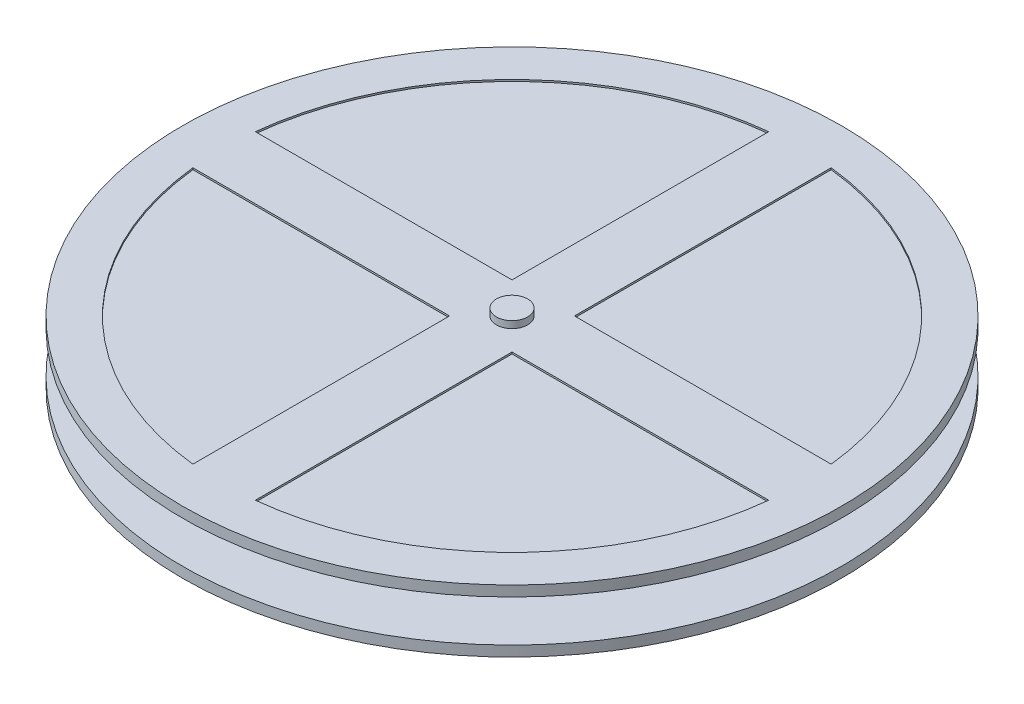
ISO-10303-21;
HEADER;
FILE_DESCRIPTION(('STEP AP214'),'2;1');
FILE_NAME('part.step','',(''),(''),'','','');
FILE_SCHEMA(('AUTOMOTIVE_DESIGN { 1 0 10303 214 1 1 1 1 }'));
ENDSEC;
DATA;
#1=APPLICATION_CONTEXT('core data for automotive mechanical design processes');
#2=APPLICATION_PROTOCOL_DEFINITION('international standard','automotive_design',2000,#1);
#3=PRODUCT_CONTEXT('',#1,'mechanical');
#4=PRODUCT('Part','Part','',(#3));
#5=PRODUCT_RELATED_PRODUCT_CATEGORY('part','',(#4));
#6=PRODUCT_DEFINITION_FORMATION('','',#4);
#7=PRODUCT_DEFINITION_CONTEXT('part definition',#1,'design');
#8=PRODUCT_DEFINITION('design','',#6,#7);
#9=PRODUCT_DEFINITION_SHAPE('','',#8);
#10=(LENGTH_UNIT() NAMED_UNIT(*) SI_UNIT(.MILLI.,.METRE.));
#11=(NAMED_UNIT(*) PLANE_ANGLE_UNIT() SI_UNIT($,.RADIAN.));
#12=(NAMED_UNIT(*) SI_UNIT($,.STERADIAN.) SOLID_ANGLE_UNIT());
#13=UNCERTAINTY_MEASURE_WITH_UNIT(LENGTH_MEASURE(1.E-05),#10,'distance_accuracy_value','');
#14=(GEOMETRIC_REPRESENTATION_CONTEXT(3) GLOBAL_UNCERTAINTY_ASSIGNED_CONTEXT((#13)) GLOBAL_UNIT_ASSIGNED_CONTEXT((#10,
#11,#12)) REPRESENTATION_CONTEXT('',''));
#15=CARTESIAN_POINT('',(0.,0.,0.));
#16=DIRECTION('',(0.,0.,1.));
#17=DIRECTION('',(1.,0.,0.));
#18=AXIS2_PLACEMENT_3D('',#15,#16,#17);
#19=CARTESIAN_POINT('',(0.,33.5,25.));
#20=DIRECTION('',(0.,-1.,0.));
#21=DIRECTION('',(0.,0.,-1.));
#22=AXIS2_PLACEMENT_3D('',#19,#20,#21);
#23=CYLINDRICAL_SURFACE('',#22,95.);
#24=CARTESIAN_POINT('',(0.,18.5,25.));
#25=DIRECTION('',(0.,-1.,0.));
#26=DIRECTION('',(0.,0.,-1.));
#27=AXIS2_PLACEMENT_3D('',#24,#25,#26);
#28=CIRCLE('',#27,95.);
#29=CARTESIAN_POINT('',(0.,18.5,-70.));
#30=VERTEX_POINT('',#29);
#31=EDGE_CURVE('E331',#30,#30,#28,.T.);
#32=ORIENTED_EDGE('',*,*,#31,.T.);
#33=EDGE_LOOP('',(#32));
#34=FACE_BOUND('',#33,.T.);
#35=CARTESIAN_POINT('',(0.,15.5,25.));
#36=DIRECTION('',(0.,1.,0.));
#37=DIRECTION('',(0.,0.,1.));
#38=AXIS2_PLACEMENT_3D('',#35,#36,#37);
#39=CIRCLE('',#38,95.);
#40=CARTESIAN_POINT('',(0.,15.5,120.));
#41=VERTEX_POINT('',#40);
#42=EDGE_CURVE('E337',#41,#41,#39,.T.);
#43=ORIENTED_EDGE('',*,*,#42,.T.);
#44=EDGE_LOOP('',(#43));
#45=FACE_BOUND('',#44,.T.);
#46=ADVANCED_FACE('F37',(#34,#45),#23,.T.);
#47=CARTESIAN_POINT('',(0.,35.5,25.));
#48=DIRECTION('',(0.,-1.,0.));
#49=DIRECTION('',(0.,0.,-1.));
#50=AXIS2_PLACEMENT_3D('',#47,#48,#49);
#51=CYLINDRICAL_SURFACE('',#50,4.5);
#52=CARTESIAN_POINT('',(0.,10.5,25.));
#53=DIRECTION('',(0.,-1.,0.));
#54=DIRECTION('',(0.,0.,-1.));
#55=AXIS2_PLACEMENT_3D('',#52,#53,#54);
#56=CIRCLE('',#55,4.5);
#57=CARTESIAN_POINT('',(0.,10.5,20.5));
#58=VERTEX_POINT('',#57);
#59=EDGE_CURVE('E46',#58,#58,#56,.F.);
#60=ORIENTED_EDGE('',*,*,#59,.T.);
#61=EDGE_LOOP('',(#60));
#62=FACE_BOUND('',#61,.T.);
#63=CARTESIAN_POINT('',(0.,15.5,25.));
#64=DIRECTION('',(0.,1.,0.));
#65=DIRECTION('',(0.,0.,1.));
#66=AXIS2_PLACEMENT_3D('',#63,#64,#65);
#67=CIRCLE('',#66,4.5);
#68=CARTESIAN_POINT('',(0.,15.5,29.5));
#69=VERTEX_POINT('',#68);
#70=EDGE_CURVE('E11',#69,#69,#67,.T.);
#71=ORIENTED_EDGE('',*,*,#70,.F.);
#72=EDGE_LOOP('',(#71));
#73=FACE_BOUND('',#72,.T.);
#74=ADVANCED_FACE('F470',(#62,#73),#51,.T.);
#75=CARTESIAN_POINT('',(0.,0.,50.));
#76=DIRECTION('',(0.,0.,-1.));
#77=DIRECTION('',(-1.,0.,0.));
#78=AXIS2_PLACEMENT_3D('',#75,#76,#77);
#79=PLANE('',#78);
#80=DIRECTION('',(0.,-1.,0.));
#81=VECTOR('',#80,1.);
#82=CARTESIAN_POINT('',(-36.,-0.999999999999999,50.));
#83=LINE('',#82,#81);
#84=CARTESIAN_POINT('',(-36.,9.,50.));
#85=VERTEX_POINT('',#84);
#86=CARTESIAN_POINT('',(-36.,-0.999999999999999,50.));
#87=VERTEX_POINT('',#86);
#88=EDGE_CURVE('E378',#85,#87,#83,.T.);
#89=ORIENTED_EDGE('',*,*,#88,.F.);
#90=DIRECTION('',(-1.,0.,0.));
#91=VECTOR('',#90,1.);
#92=CARTESIAN_POINT('',(-36.,9.,50.));
#93=LINE('',#92,#91);
#94=CARTESIAN_POINT('',(-26.,9.,50.));
#95=VERTEX_POINT('',#94);
#96=EDGE_CURVE('E386',#95,#85,#93,.T.);
#97=ORIENTED_EDGE('',*,*,#96,.F.);
#98=DIRECTION('',(0.,1.,0.));
#99=VECTOR('',#98,1.);
#100=CARTESIAN_POINT('',(-26.,-0.999999999999999,50.));
#101=LINE('',#100,#99);
#102=CARTESIAN_POINT('',(-26.,-0.999999999999999,50.));
#103=VERTEX_POINT('',#102);
#104=EDGE_CURVE('E383',#103,#95,#101,.T.);
#105=ORIENTED_EDGE('',*,*,#104,.F.);
#106=DIRECTION('',(1.,0.,0.));
#107=VECTOR('',#106,1.);
#108=CARTESIAN_POINT('',(-36.,-0.999999999999999,50.));
#109=LINE('',#108,#107);
#110=EDGE_CURVE('E380',#87,#103,#109,.T.);
#111=ORIENTED_EDGE('',*,*,#110,.F.);
#112=EDGE_LOOP('',(#89,#97,#105,#111));
#113=FACE_BOUND('',#112,.T.);
#114=DIRECTION('',(0.,1.,0.));
#115=VECTOR('',#114,1.);
#116=CARTESIAN_POINT('',(39.,-10.5,50.));
#117=LINE('',#116,#115);
#118=CARTESIAN_POINT('',(39.,-8.00000000000001,50.));
#119=VERTEX_POINT('',#118);
#120=CARTESIAN_POINT('',(39.,9.99999999999999,50.));
#121=VERTEX_POINT('',#120);
#122=EDGE_CURVE('E409',#119,#121,#117,.T.);
#123=ORIENTED_EDGE('',*,*,#122,.T.);
#124=DIRECTION('',(0.707106781186548,-0.707106781186548,0.));
#125=VECTOR('',#124,1.);
#126=CARTESIAN_POINT('',(38.5,10.5,50.));
#127=LINE('',#126,#125);
#128=CARTESIAN_POINT('',(38.5,10.5,50.));
#129=VERTEX_POINT('',#128);
#130=EDGE_CURVE('E463',#121,#129,#127,.F.);
#131=ORIENTED_EDGE('',*,*,#130,.T.);
#132=DIRECTION('',(-1.,0.,0.));
#133=VECTOR('',#132,1.);
#134=CARTESIAN_POINT('',(-39.,10.5,50.));
#135=LINE('',#134,#133);
#136=CARTESIAN_POINT('',(-38.5,10.5,50.));
#137=VERTEX_POINT('',#136);
#138=EDGE_CURVE('E412',#129,#137,#135,.T.);
#139=ORIENTED_EDGE('',*,*,#138,.T.);
#140=DIRECTION('',(0.707106781186548,0.707106781186548,0.));
#141=VECTOR('',#140,1.);
#142=CARTESIAN_POINT('',(-39.,10.,50.));
#143=LINE('',#142,#141);
#144=CARTESIAN_POINT('',(-39.,9.99999999999999,50.));
#145=VERTEX_POINT('',#144);
#146=EDGE_CURVE('E461',#137,#145,#143,.F.);
#147=ORIENTED_EDGE('',*,*,#146,.T.);
#148=DIRECTION('',(0.,-1.,0.));
#149=VECTOR('',#148,1.);
#150=CARTESIAN_POINT('',(-39.,-10.5,50.));
#151=LINE('',#150,#149);
#152=CARTESIAN_POINT('',(-39.,-8.,50.));
#153=VERTEX_POINT('',#152);
#154=EDGE_CURVE('E416',#145,#153,#151,.T.);
#155=ORIENTED_EDGE('',*,*,#154,.T.);
#156=DIRECTION('',(-0.707106781186548,0.707106781186548,0.));
#157=VECTOR('',#156,1.);
#158=CARTESIAN_POINT('',(-36.5,-10.5,50.));
#159=LINE('',#158,#157);
#160=CARTESIAN_POINT('',(-36.5,-10.5,50.));
#161=VERTEX_POINT('',#160);
#162=EDGE_CURVE('E443',#153,#161,#159,.F.);
#163=ORIENTED_EDGE('',*,*,#162,.T.);
#164=DIRECTION('',(1.,0.,0.));
#165=VECTOR('',#164,1.);
#166=CARTESIAN_POINT('',(-39.,-10.5,50.));
#167=LINE('',#166,#165);
#168=CARTESIAN_POINT('',(36.5,-10.5,50.));
#169=VERTEX_POINT('',#168);
#170=EDGE_CURVE('E418',#161,#169,#167,.T.);
#171=ORIENTED_EDGE('',*,*,#170,.T.);
#172=DIRECTION('',(-0.707106781186549,-0.707106781186546,0.));
#173=VECTOR('',#172,1.);
#174=CARTESIAN_POINT('',(39.,-8.00000000000001,50.));
#175=LINE('',#174,#173);
#176=EDGE_CURVE('E445',#169,#119,#175,.F.);
#177=ORIENTED_EDGE('',*,*,#176,.T.);
#178=EDGE_LOOP('',(#123,#131,#139,#147,#155,#163,#171,#177));
#179=FACE_BOUND('',#178,.T.);
#180=DIRECTION('',(-1.,0.,0.));
#181=VECTOR('',#180,1.);
#182=CARTESIAN_POINT('',(26.,9.,50.));
#183=LINE('',#182,#181);
#184=CARTESIAN_POINT('',(36.,9.,50.));
#185=VERTEX_POINT('',#184);
#186=CARTESIAN_POINT('',(26.,9.,50.));
#187=VERTEX_POINT('',#186);
#188=EDGE_CURVE('E347',#185,#187,#183,.T.);
#189=ORIENTED_EDGE('',*,*,#188,.F.);
#190=DIRECTION('',(0.,1.,0.));
#191=VECTOR('',#190,1.);
#192=CARTESIAN_POINT('',(36.,-0.999999999999999,50.));
#193=LINE('',#192,#191);
#194=CARTESIAN_POINT('',(36.,-0.999999999999999,50.));
#195=VERTEX_POINT('',#194);
#196=EDGE_CURVE('E355',#195,#185,#193,.T.);
#197=ORIENTED_EDGE('',*,*,#196,.F.);
#198=DIRECTION('',(1.,0.,0.));
#199=VECTOR('',#198,1.);
#200=CARTESIAN_POINT('',(26.,-0.999999999999999,50.));
#201=LINE('',#200,#199);
#202=CARTESIAN_POINT('',(26.,-0.999999999999999,50.));
#203=VERTEX_POINT('',#202);
#204=EDGE_CURVE('E352',#203,#195,#201,.T.);
#205=ORIENTED_EDGE('',*,*,#204,.F.);
#206=DIRECTION('',(0.,-1.,0.));
#207=VECTOR('',#206,1.);
#208=CARTESIAN_POINT('',(26.,-0.999999999999999,50.));
#209=LINE('',#208,#207);
#210=EDGE_CURVE('E349',#187,#203,#209,.T.);
#211=ORIENTED_EDGE('',*,*,#210,.F.);
#212=EDGE_LOOP('',(#189,#197,#205,#211));
#213=FACE_BOUND('',#212,.T.);
#214=ADVANCED_FACE('F514',(#113,#179,#213),#79,.F.);
#215=CARTESIAN_POINT('',(0.,0.,0.));
#216=DIRECTION('',(0.,0.,-1.));
#217=DIRECTION('',(-1.,0.,0.));
#218=AXIS2_PLACEMENT_3D('',#215,#216,#217);
#219=PLANE('',#218);
#220=DIRECTION('',(-1.,0.,0.));
#221=VECTOR('',#220,1.);
#222=CARTESIAN_POINT('',(-39.,10.5,0.));
#223=LINE('',#222,#221);
#224=CARTESIAN_POINT('',(38.5,10.5,0.));
#225=VERTEX_POINT('',#224);
#226=CARTESIAN_POINT('',(-38.5,10.5,0.));
#227=VERTEX_POINT('',#226);
#228=EDGE_CURVE('E424',#225,#227,#223,.T.);
#229=ORIENTED_EDGE('',*,*,#228,.F.);
#230=DIRECTION('',(-0.707106781186548,0.707106781186548,0.));
#231=VECTOR('',#230,1.);
#232=CARTESIAN_POINT('',(24.5,24.5,0.));
#233=LINE('',#232,#231);
#234=CARTESIAN_POINT('',(39.,9.99999999999999,0.));
#235=VERTEX_POINT('',#234);
#236=EDGE_CURVE('E457',#225,#235,#233,.F.);
#237=ORIENTED_EDGE('',*,*,#236,.T.);
#238=DIRECTION('',(0.,1.,0.));
#239=VECTOR('',#238,1.);
#240=CARTESIAN_POINT('',(39.,-10.5,0.));
#241=LINE('',#240,#239);
#242=CARTESIAN_POINT('',(39.,-8.00000000000001,0.));
#243=VERTEX_POINT('',#242);
#244=EDGE_CURVE('E408',#243,#235,#241,.T.);
#245=ORIENTED_EDGE('',*,*,#244,.F.);
#246=DIRECTION('',(0.707106781186549,0.707106781186546,0.));
#247=VECTOR('',#246,1.);
#248=CARTESIAN_POINT('',(23.4999999999999,-23.5,0.));
#249=LINE('',#248,#247);
#250=CARTESIAN_POINT('',(36.5,-10.5,0.));
#251=VERTEX_POINT('',#250);
#252=EDGE_CURVE('E436',#243,#251,#249,.F.);
#253=ORIENTED_EDGE('',*,*,#252,.T.);
#254=DIRECTION('',(1.,0.,0.));
#255=VECTOR('',#254,1.);
#256=CARTESIAN_POINT('',(-39.,-10.5,0.));
#257=LINE('',#256,#255);
#258=CARTESIAN_POINT('',(-36.5,-10.5,0.));
#259=VERTEX_POINT('',#258);
#260=EDGE_CURVE('E413',#259,#251,#257,.T.);
#261=ORIENTED_EDGE('',*,*,#260,.F.);
#262=DIRECTION('',(0.707106781186548,-0.707106781186548,0.));
#263=VECTOR('',#262,1.);
#264=CARTESIAN_POINT('',(-23.5,-23.5,0.));
#265=LINE('',#264,#263);
#266=CARTESIAN_POINT('',(-39.,-8.,0.));
#267=VERTEX_POINT('',#266);
#268=EDGE_CURVE('E433',#259,#267,#265,.F.);
#269=ORIENTED_EDGE('',*,*,#268,.T.);
#270=DIRECTION('',(0.,-1.,0.));
#271=VECTOR('',#270,1.);
#272=CARTESIAN_POINT('',(-39.,-10.5,0.));
#273=LINE('',#272,#271);
#274=CARTESIAN_POINT('',(-39.,9.99999999999999,0.));
#275=VERTEX_POINT('',#274);
#276=EDGE_CURVE('E427',#275,#267,#273,.T.);
#277=ORIENTED_EDGE('',*,*,#276,.F.);
#278=DIRECTION('',(-0.707106781186548,-0.707106781186548,0.));
#279=VECTOR('',#278,1.);
#280=CARTESIAN_POINT('',(-24.5,24.5,0.));
#281=LINE('',#280,#279);
#282=EDGE_CURVE('E455',#275,#227,#281,.F.);
#283=ORIENTED_EDGE('',*,*,#282,.T.);
#284=EDGE_LOOP('',(#229,#237,#245,#253,#261,#269,#277,#283));
#285=FACE_BOUND('',#284,.T.);
#286=DIRECTION('',(-1.,0.,0.));
#287=VECTOR('',#286,1.);
#288=CARTESIAN_POINT('',(-36.,9.,0.));
#289=LINE('',#288,#287);
#290=CARTESIAN_POINT('',(-26.,9.,0.));
#291=VERTEX_POINT('',#290);
#292=CARTESIAN_POINT('',(-36.,9.,0.));
#293=VERTEX_POINT('',#292);
#294=EDGE_CURVE('E381',#291,#293,#289,.T.);
#295=ORIENTED_EDGE('',*,*,#294,.T.);
#296=DIRECTION('',(0.,-1.,0.));
#297=VECTOR('',#296,1.);
#298=CARTESIAN_POINT('',(-36.,-0.999999999999999,0.));
#299=LINE('',#298,#297);
#300=CARTESIAN_POINT('',(-36.,-0.999999999999999,0.));
#301=VERTEX_POINT('',#300);
#302=EDGE_CURVE('E377',#293,#301,#299,.T.);
#303=ORIENTED_EDGE('',*,*,#302,.T.);
#304=DIRECTION('',(1.,0.,0.));
#305=VECTOR('',#304,1.);
#306=CARTESIAN_POINT('',(-36.,-0.999999999999999,0.));
#307=LINE('',#306,#305);
#308=CARTESIAN_POINT('',(-26.,-0.999999999999999,0.));
#309=VERTEX_POINT('',#308);
#310=EDGE_CURVE('E391',#301,#309,#307,.T.);
#311=ORIENTED_EDGE('',*,*,#310,.T.);
#312=DIRECTION('',(0.,1.,0.));
#313=VECTOR('',#312,1.);
#314=CARTESIAN_POINT('',(-26.,-0.999999999999999,0.));
#315=LINE('',#314,#313);
#316=EDGE_CURVE('E394',#309,#291,#315,.T.);
#317=ORIENTED_EDGE('',*,*,#316,.T.);
#318=EDGE_LOOP('',(#295,#303,#311,#317));
#319=FACE_BOUND('',#318,.T.);
#320=DIRECTION('',(0.,1.,0.));
#321=VECTOR('',#320,1.);
#322=CARTESIAN_POINT('',(36.,-0.999999999999999,0.));
#323=LINE('',#322,#321);
#324=CARTESIAN_POINT('',(36.,-0.999999999999999,0.));
#325=VERTEX_POINT('',#324);
#326=CARTESIAN_POINT('',(36.,9.,0.));
#327=VERTEX_POINT('',#326);
#328=EDGE_CURVE('E350',#325,#327,#323,.T.);
#329=ORIENTED_EDGE('',*,*,#328,.T.);
#330=DIRECTION('',(-1.,0.,0.));
#331=VECTOR('',#330,1.);
#332=CARTESIAN_POINT('',(26.,9.,0.));
#333=LINE('',#332,#331);
#334=CARTESIAN_POINT('',(26.,9.,0.));
#335=VERTEX_POINT('',#334);
#336=EDGE_CURVE('E346',#327,#335,#333,.T.);
#337=ORIENTED_EDGE('',*,*,#336,.T.);
#338=DIRECTION('',(0.,-1.,0.));
#339=VECTOR('',#338,1.);
#340=CARTESIAN_POINT('',(26.,-0.999999999999999,0.));
#341=LINE('',#340,#339);
#342=CARTESIAN_POINT('',(26.,-0.999999999999999,0.));
#343=VERTEX_POINT('',#342);
#344=EDGE_CURVE('E360',#335,#343,#341,.T.);
#345=ORIENTED_EDGE('',*,*,#344,.T.);
#346=DIRECTION('',(1.,0.,0.));
#347=VECTOR('',#346,1.);
#348=CARTESIAN_POINT('',(26.,-0.999999999999999,0.));
#349=LINE('',#348,#347);
#350=EDGE_CURVE('E363',#343,#325,#349,.T.);
#351=ORIENTED_EDGE('',*,*,#350,.T.);
#352=EDGE_LOOP('',(#329,#337,#345,#351));
#353=FACE_BOUND('',#352,.T.);
#354=ADVANCED_FACE('F491',(#285,#319,#353),#219,.T.);
#355=CARTESIAN_POINT('',(39.,-10.5,50.));
#356=DIRECTION('',(-1.,0.,0.));
#357=DIRECTION('',(0.,0.,1.));
#358=AXIS2_PLACEMENT_3D('',#355,#356,#357);
#359=PLANE('',#358);
#360=ORIENTED_EDGE('',*,*,#244,.T.);
#361=DIRECTION('',(0.,0.,1.));
#362=VECTOR('',#361,1.);
#363=CARTESIAN_POINT('',(39.,10.,50.));
#364=LINE('',#363,#362);
#365=EDGE_CURVE('E459',#235,#121,#364,.T.);
#366=ORIENTED_EDGE('',*,*,#365,.T.);
#367=ORIENTED_EDGE('',*,*,#122,.F.);
#368=DIRECTION('',(0.,0.,-1.));
#369=VECTOR('',#368,1.);
#370=CARTESIAN_POINT('',(39.,-8.00000000000001,50.));
#371=LINE('',#370,#369);
#372=EDGE_CURVE('E421',#119,#243,#371,.T.);
#373=ORIENTED_EDGE('',*,*,#372,.T.);
#374=EDGE_LOOP('',(#360,#366,#367,#373));
#375=FACE_BOUND('',#374,.T.);
#376=ADVANCED_FACE('F477',(#375),#359,.F.);
#377=CARTESIAN_POINT('',(-39.,10.5,50.));
#378=DIRECTION('',(0.,-1.,0.));
#379=DIRECTION('',(0.,0.,-1.));
#380=AXIS2_PLACEMENT_3D('',#377,#378,#379);
#381=PLANE('',#380);
#382=ORIENTED_EDGE('',*,*,#59,.F.);
#383=EDGE_LOOP('',(#382));
#384=FACE_BOUND('',#383,.T.);
#385=ORIENTED_EDGE('',*,*,#138,.F.);
#386=DIRECTION('',(0.,0.,-1.));
#387=VECTOR('',#386,1.);
#388=CARTESIAN_POINT('',(38.5,10.5,50.));
#389=LINE('',#388,#387);
#390=EDGE_CURVE('E452',#129,#225,#389,.T.);
#391=ORIENTED_EDGE('',*,*,#390,.T.);
#392=ORIENTED_EDGE('',*,*,#228,.T.);
#393=DIRECTION('',(0.,0.,1.));
#394=VECTOR('',#393,1.);
#395=CARTESIAN_POINT('',(-38.5,10.5,50.));
#396=LINE('',#395,#394);
#397=EDGE_CURVE('E450',#227,#137,#396,.T.);
#398=ORIENTED_EDGE('',*,*,#397,.T.);
#399=EDGE_LOOP('',(#385,#391,#392,#398));
#400=FACE_BOUND('',#399,.T.);
#401=ADVANCED_FACE('F473',(#384,#400),#381,.F.);
#402=CARTESIAN_POINT('',(-39.,-10.5,50.));
#403=DIRECTION('',(1.,0.,0.));
#404=DIRECTION('',(0.,0.,-1.));
#405=AXIS2_PLACEMENT_3D('',#402,#403,#404);
#406=PLANE('',#405);
#407=ORIENTED_EDGE('',*,*,#154,.F.);
#408=DIRECTION('',(0.,0.,-1.));
#409=VECTOR('',#408,1.);
#410=CARTESIAN_POINT('',(-39.,10.,50.));
#411=LINE('',#410,#409);
#412=EDGE_CURVE('E465',#145,#275,#411,.T.);
#413=ORIENTED_EDGE('',*,*,#412,.T.);
#414=ORIENTED_EDGE('',*,*,#276,.T.);
#415=DIRECTION('',(0.,0.,1.));
#416=VECTOR('',#415,1.);
#417=CARTESIAN_POINT('',(-39.,-8.,50.));
#418=LINE('',#417,#416);
#419=EDGE_CURVE('E447',#267,#153,#418,.T.);
#420=ORIENTED_EDGE('',*,*,#419,.T.);
#421=EDGE_LOOP('',(#407,#413,#414,#420));
#422=FACE_BOUND('',#421,.T.);
#423=ADVANCED_FACE('F476',(#422),#406,.F.);
#424=CARTESIAN_POINT('',(-39.,-10.5,50.));
#425=DIRECTION('',(0.,1.,0.));
#426=DIRECTION('',(0.,0.,1.));
#427=AXIS2_PLACEMENT_3D('',#424,#425,#426);
#428=PLANE('',#427);
#429=ORIENTED_EDGE('',*,*,#260,.T.);
#430=DIRECTION('',(0.,0.,1.));
#431=VECTOR('',#430,1.);
#432=CARTESIAN_POINT('',(36.5,-10.5,50.));
#433=LINE('',#432,#431);
#434=EDGE_CURVE('E441',#251,#169,#433,.T.);
#435=ORIENTED_EDGE('',*,*,#434,.T.);
#436=ORIENTED_EDGE('',*,*,#170,.F.);
#437=DIRECTION('',(0.,0.,-1.));
#438=VECTOR('',#437,1.);
#439=CARTESIAN_POINT('',(-36.5,-10.5,50.));
#440=LINE('',#439,#438);
#441=EDGE_CURVE('E438',#161,#259,#440,.T.);
#442=ORIENTED_EDGE('',*,*,#441,.T.);
#443=EDGE_LOOP('',(#429,#435,#436,#442));
#444=FACE_BOUND('',#443,.T.);
#445=ADVANCED_FACE('F502',(#444),#428,.F.);
#446=CARTESIAN_POINT('',(-36.,-0.999999999999999,50.));
#447=DIRECTION('',(1.,0.,0.));
#448=DIRECTION('',(0.,0.,-1.));
#449=AXIS2_PLACEMENT_3D('',#446,#447,#448);
#450=PLANE('',#449);
#451=ORIENTED_EDGE('',*,*,#302,.F.);
#452=DIRECTION('',(0.,0.,-1.));
#453=VECTOR('',#452,1.);
#454=CARTESIAN_POINT('',(-36.,9.,50.));
#455=LINE('',#454,#453);
#456=EDGE_CURVE('E388',#85,#293,#455,.T.);
#457=ORIENTED_EDGE('',*,*,#456,.F.);
#458=ORIENTED_EDGE('',*,*,#88,.T.);
#459=DIRECTION('',(0.,0.,-1.));
#460=VECTOR('',#459,1.);
#461=CARTESIAN_POINT('',(-36.,-0.999999999999999,50.));
#462=LINE('',#461,#460);
#463=EDGE_CURVE('E405',#87,#301,#462,.T.);
#464=ORIENTED_EDGE('',*,*,#463,.T.);
#465=EDGE_LOOP('',(#451,#457,#458,#464));
#466=FACE_BOUND('',#465,.T.);
#467=ADVANCED_FACE('F636',(#466),#450,.T.);
#468=CARTESIAN_POINT('',(-36.,-0.999999999999999,50.));
#469=DIRECTION('',(0.,1.,0.));
#470=DIRECTION('',(0.,0.,1.));
#471=AXIS2_PLACEMENT_3D('',#468,#469,#470);
#472=PLANE('',#471);
#473=ORIENTED_EDGE('',*,*,#310,.F.);
#474=ORIENTED_EDGE('',*,*,#463,.F.);
#475=ORIENTED_EDGE('',*,*,#110,.T.);
#476=DIRECTION('',(0.,0.,-1.));
#477=VECTOR('',#476,1.);
#478=CARTESIAN_POINT('',(-26.,-0.999999999999999,50.));
#479=LINE('',#478,#477);
#480=EDGE_CURVE('E403',#103,#309,#479,.T.);
#481=ORIENTED_EDGE('',*,*,#480,.T.);
#482=EDGE_LOOP('',(#473,#474,#475,#481));
#483=FACE_BOUND('',#482,.T.);
#484=ADVANCED_FACE('F641',(#483),#472,.T.);
#485=CARTESIAN_POINT('',(-26.,-0.999999999999999,50.));
#486=DIRECTION('',(-1.,0.,0.));
#487=DIRECTION('',(0.,0.,1.));
#488=AXIS2_PLACEMENT_3D('',#485,#486,#487);
#489=PLANE('',#488);
#490=ORIENTED_EDGE('',*,*,#316,.F.);
#491=ORIENTED_EDGE('',*,*,#480,.F.);
#492=ORIENTED_EDGE('',*,*,#104,.T.);
#493=DIRECTION('',(0.,0.,-1.));
#494=VECTOR('',#493,1.);
#495=CARTESIAN_POINT('',(-26.,9.,50.));
#496=LINE('',#495,#494);
#497=EDGE_CURVE('E401',#95,#291,#496,.T.);
#498=ORIENTED_EDGE('',*,*,#497,.T.);
#499=EDGE_LOOP('',(#490,#491,#492,#498));
#500=FACE_BOUND('',#499,.T.);
#501=ADVANCED_FACE('F645',(#500),#489,.T.);
#502=CARTESIAN_POINT('',(-36.,9.,50.));
#503=DIRECTION('',(0.,-1.,0.));
#504=DIRECTION('',(0.,0.,-1.));
#505=AXIS2_PLACEMENT_3D('',#502,#503,#504);
#506=PLANE('',#505);
#507=ORIENTED_EDGE('',*,*,#294,.F.);
#508=ORIENTED_EDGE('',*,*,#497,.F.);
#509=ORIENTED_EDGE('',*,*,#96,.T.);
#510=ORIENTED_EDGE('',*,*,#456,.T.);
#511=EDGE_LOOP('',(#507,#508,#509,#510));
#512=FACE_BOUND('',#511,.T.);
#513=ADVANCED_FACE('F649',(#512),#506,.T.);
#514=CARTESIAN_POINT('',(26.,9.,50.));
#515=DIRECTION('',(0.,-1.,0.));
#516=DIRECTION('',(0.,0.,-1.));
#517=AXIS2_PLACEMENT_3D('',#514,#515,#516);
#518=PLANE('',#517);
#519=ORIENTED_EDGE('',*,*,#336,.F.);
#520=DIRECTION('',(0.,0.,-1.));
#521=VECTOR('',#520,1.);
#522=CARTESIAN_POINT('',(36.,9.,50.));
#523=LINE('',#522,#521);
#524=EDGE_CURVE('E357',#185,#327,#523,.T.);
#525=ORIENTED_EDGE('',*,*,#524,.F.);
#526=ORIENTED_EDGE('',*,*,#188,.T.);
#527=DIRECTION('',(0.,0.,-1.));
#528=VECTOR('',#527,1.);
#529=CARTESIAN_POINT('',(26.,9.,50.));
#530=LINE('',#529,#528);
#531=EDGE_CURVE('E374',#187,#335,#530,.T.);
#532=ORIENTED_EDGE('',*,*,#531,.T.);
#533=EDGE_LOOP('',(#519,#525,#526,#532));
#534=FACE_BOUND('',#533,.T.);
#535=ADVANCED_FACE('F526',(#534),#518,.T.);
#536=CARTESIAN_POINT('',(26.,-0.999999999999999,50.));
#537=DIRECTION('',(1.,0.,0.));
#538=DIRECTION('',(0.,0.,-1.));
#539=AXIS2_PLACEMENT_3D('',#536,#537,#538);
#540=PLANE('',#539);
#541=ORIENTED_EDGE('',*,*,#344,.F.);
#542=ORIENTED_EDGE('',*,*,#531,.F.);
#543=ORIENTED_EDGE('',*,*,#210,.T.);
#544=DIRECTION('',(0.,0.,-1.));
#545=VECTOR('',#544,1.);
#546=CARTESIAN_POINT('',(26.,-0.999999999999999,50.));
#547=LINE('',#546,#545);
#548=EDGE_CURVE('E372',#203,#343,#547,.T.);
#549=ORIENTED_EDGE('',*,*,#548,.T.);
#550=EDGE_LOOP('',(#541,#542,#543,#549));
#551=FACE_BOUND('',#550,.T.);
#552=ADVANCED_FACE('F528',(#551),#540,.T.);
#553=CARTESIAN_POINT('',(26.,-0.999999999999999,50.));
#554=DIRECTION('',(0.,1.,0.));
#555=DIRECTION('',(0.,0.,1.));
#556=AXIS2_PLACEMENT_3D('',#553,#554,#555);
#557=PLANE('',#556);
#558=ORIENTED_EDGE('',*,*,#350,.F.);
#559=ORIENTED_EDGE('',*,*,#548,.F.);
#560=ORIENTED_EDGE('',*,*,#204,.T.);
#561=DIRECTION('',(0.,0.,-1.));
#562=VECTOR('',#561,1.);
#563=CARTESIAN_POINT('',(36.,-0.999999999999999,50.));
#564=LINE('',#563,#562);
#565=EDGE_CURVE('E370',#195,#325,#564,.T.);
#566=ORIENTED_EDGE('',*,*,#565,.T.);
#567=EDGE_LOOP('',(#558,#559,#560,#566));
#568=FACE_BOUND('',#567,.T.);
#569=ADVANCED_FACE('F536',(#568),#557,.T.);
#570=CARTESIAN_POINT('',(36.,-0.999999999999999,50.));
#571=DIRECTION('',(-1.,0.,0.));
#572=DIRECTION('',(0.,0.,1.));
#573=AXIS2_PLACEMENT_3D('',#570,#571,#572);
#574=PLANE('',#573);
#575=ORIENTED_EDGE('',*,*,#328,.F.);
#576=ORIENTED_EDGE('',*,*,#565,.F.);
#577=ORIENTED_EDGE('',*,*,#196,.T.);
#578=ORIENTED_EDGE('',*,*,#524,.T.);
#579=EDGE_LOOP('',(#575,#576,#577,#578));
#580=FACE_BOUND('',#579,.T.);
#581=ADVANCED_FACE('F534',(#580),#574,.T.);
#582=CARTESIAN_POINT('',(39.,-8.00000000000001,50.));
#583=DIRECTION('',(-0.707106781186546,0.707106781186549,0.));
#584=DIRECTION('',(0.,0.,-1.));
#585=AXIS2_PLACEMENT_3D('',#582,#583,#584);
#586=PLANE('',#585);
#587=ORIENTED_EDGE('',*,*,#176,.F.);
#588=ORIENTED_EDGE('',*,*,#434,.F.);
#589=ORIENTED_EDGE('',*,*,#252,.F.);
#590=ORIENTED_EDGE('',*,*,#372,.F.);
#591=EDGE_LOOP('',(#587,#588,#589,#590));
#592=FACE_BOUND('',#591,.T.);
#593=ADVANCED_FACE('F498',(#592),#586,.F.);
#594=CARTESIAN_POINT('',(-36.5,-10.5,50.));
#595=DIRECTION('',(0.707106781186547,0.707106781186547,0.));
#596=DIRECTION('',(0.,0.,-1.));
#597=AXIS2_PLACEMENT_3D('',#594,#595,#596);
#598=PLANE('',#597);
#599=ORIENTED_EDGE('',*,*,#162,.F.);
#600=ORIENTED_EDGE('',*,*,#419,.F.);
#601=ORIENTED_EDGE('',*,*,#268,.F.);
#602=ORIENTED_EDGE('',*,*,#441,.F.);
#603=EDGE_LOOP('',(#599,#600,#601,#602));
#604=FACE_BOUND('',#603,.T.);
#605=ADVANCED_FACE('F507',(#604),#598,.F.);
#606=CARTESIAN_POINT('',(38.5,10.5,50.));
#607=DIRECTION('',(-0.707106781186547,-0.707106781186547,0.));
#608=DIRECTION('',(0.,0.,-1.));
#609=AXIS2_PLACEMENT_3D('',#606,#607,#608);
#610=PLANE('',#609);
#611=ORIENTED_EDGE('',*,*,#130,.F.);
#612=ORIENTED_EDGE('',*,*,#365,.F.);
#613=ORIENTED_EDGE('',*,*,#236,.F.);
#614=ORIENTED_EDGE('',*,*,#390,.F.);
#615=EDGE_LOOP('',(#611,#612,#613,#614));
#616=FACE_BOUND('',#615,.T.);
#617=ADVANCED_FACE('F487',(#616),#610,.F.);
#618=CARTESIAN_POINT('',(-39.,10.,50.));
#619=DIRECTION('',(0.707106781186547,-0.707106781186547,0.));
#620=DIRECTION('',(0.,0.,-1.));
#621=AXIS2_PLACEMENT_3D('',#618,#619,#620);
#622=PLANE('',#621);
#623=ORIENTED_EDGE('',*,*,#146,.F.);
#624=ORIENTED_EDGE('',*,*,#397,.F.);
#625=ORIENTED_EDGE('',*,*,#282,.F.);
#626=ORIENTED_EDGE('',*,*,#412,.F.);
#627=EDGE_LOOP('',(#623,#624,#625,#626));
#628=FACE_BOUND('',#627,.T.);
#629=ADVANCED_FACE('F40',(#628),#622,.F.);
#630=CARTESIAN_POINT('',(0.,15.5,25.));
#631=DIRECTION('',(0.,1.,0.));
#632=DIRECTION('',(0.,0.,1.));
#633=AXIS2_PLACEMENT_3D('',#630,#631,#632);
#634=PLANE('',#633);
#635=ORIENTED_EDGE('',*,*,#42,.F.);
#636=EDGE_LOOP('',(#635));
#637=FACE_BOUND('',#636,.T.);
#638=ORIENTED_EDGE('',*,*,#70,.T.);
#639=EDGE_LOOP('',(#638));
#640=FACE_BOUND('',#639,.T.);
#641=ADVANCED_FACE('F601',(#637,#640),#634,.F.);
#642=CARTESIAN_POINT('',(0.,18.5,-70.));
#643=DIRECTION('',(0.,-1.,0.));
#644=DIRECTION('',(0.,0.,-1.));
#645=AXIS2_PLACEMENT_3D('',#642,#643,#644);
#646=PLANE('',#645);
#647=ORIENTED_EDGE('',*,*,#31,.F.);
#648=EDGE_LOOP('',(#647));
#649=FACE_BOUND('',#648,.T.);
#650=CARTESIAN_POINT('',(0.,18.5,25.));
#651=DIRECTION('',(0.,-1.,0.));
#652=DIRECTION('',(0.,0.,-1.));
#653=AXIS2_PLACEMENT_3D('',#650,#651,#652);
#654=CIRCLE('',#653,9.);
#655=CARTESIAN_POINT('',(0.,18.5,16.));
#656=VERTEX_POINT('',#655);
#657=EDGE_CURVE('E328',#656,#656,#654,.T.);
#658=ORIENTED_EDGE('',*,*,#657,.T.);
#659=EDGE_LOOP('',(#658));
#660=FACE_BOUND('',#659,.T.);
#661=ADVANCED_FACE('F593',(#649,#660),#646,.F.);
#662=CARTESIAN_POINT('',(0.,10.5,25.));
#663=DIRECTION('',(0.,-1.,0.));
#664=DIRECTION('',(0.,0.,-1.));
#665=AXIS2_PLACEMENT_3D('',#662,#663,#664);
#666=CYLINDRICAL_SURFACE('',#665,9.);
#667=ORIENTED_EDGE('',*,*,#657,.F.);
#668=EDGE_LOOP('',(#667));
#669=FACE_BOUND('',#668,.T.);
#670=CARTESIAN_POINT('',(0.,30.5,25.));
#671=DIRECTION('',(0.,-1.,0.));
#672=DIRECTION('',(0.,0.,-1.));
#673=AXIS2_PLACEMENT_3D('',#670,#671,#672);
#674=CIRCLE('',#673,9.);
#675=CARTESIAN_POINT('',(0.,30.5,16.));
#676=VERTEX_POINT('',#675);
#677=EDGE_CURVE('E325',#676,#676,#674,.T.);
#678=ORIENTED_EDGE('',*,*,#677,.T.);
#679=EDGE_LOOP('',(#678));
#680=FACE_BOUND('',#679,.T.);
#681=ADVANCED_FACE('F587',(#669,#680),#666,.T.);
#682=CARTESIAN_POINT('',(0.,30.5,-70.));
#683=DIRECTION('',(0.,1.,0.));
#684=DIRECTION('',(0.,0.,1.));
#685=AXIS2_PLACEMENT_3D('',#682,#683,#684);
#686=PLANE('',#685);
#687=ORIENTED_EDGE('',*,*,#677,.F.);
#688=EDGE_LOOP('',(#687));
#689=FACE_BOUND('',#688,.T.);
#690=CARTESIAN_POINT('',(0.,30.5,25.));
#691=DIRECTION('',(0.,-1.,0.));
#692=DIRECTION('',(0.,0.,-1.));
#693=AXIS2_PLACEMENT_3D('',#690,#691,#692);
#694=CIRCLE('',#693,95.);
#695=CARTESIAN_POINT('',(0.,30.5,-70.));
#696=VERTEX_POINT('',#695);
#697=EDGE_CURVE('E318',#696,#696,#694,.T.);
#698=ORIENTED_EDGE('',*,*,#697,.T.);
#699=EDGE_LOOP('',(#698));
#700=FACE_BOUND('',#699,.T.);
#701=ADVANCED_FACE('F583',(#689,#700),#686,.F.);
#702=CARTESIAN_POINT('',(0.,35.5,25.));
#703=DIRECTION('',(0.,1.,0.));
#704=DIRECTION('',(0.,0.,1.));
#705=AXIS2_PLACEMENT_3D('',#702,#703,#704);
#706=PLANE('',#705);
#707=CARTESIAN_POINT('',(0.,35.5,25.));
#708=DIRECTION('',(0.,1.,0.));
#709=DIRECTION('',(0.,0.,1.));
#710=AXIS2_PLACEMENT_3D('',#707,#708,#709);
#711=CIRCLE('',#710,4.5);
#712=CARTESIAN_POINT('',(0.,35.5,29.5));
#713=VERTEX_POINT('',#712);
#714=EDGE_CURVE('E341',#713,#713,#711,.T.);
#715=ORIENTED_EDGE('',*,*,#714,.T.);
#716=EDGE_LOOP('',(#715));
#717=FACE_BOUND('',#716,.T.);
#718=ADVANCED_FACE('F579',(#717),#706,.T.);
#719=CARTESIAN_POINT('',(0.,33.5,25.));
#720=DIRECTION('',(0.,1.,0.));
#721=DIRECTION('',(0.,0.,1.));
#722=AXIS2_PLACEMENT_3D('',#719,#720,#721);
#723=CIRCLE('',#722,4.5);
#724=CARTESIAN_POINT('',(0.,33.5,29.5));
#725=VERTEX_POINT('',#724);
#726=EDGE_CURVE('E334',#725,#725,#723,.T.);
#727=ORIENTED_EDGE('',*,*,#726,.T.);
#728=EDGE_LOOP('',(#727));
#729=FACE_BOUND('',#728,.T.);
#730=ORIENTED_EDGE('',*,*,#714,.F.);
#731=EDGE_LOOP('',(#730));
#732=FACE_BOUND('',#731,.T.);
#733=ADVANCED_FACE('F553',(#729,#732),#51,.T.);
#734=CARTESIAN_POINT('',(0.,33.5,25.));
#735=DIRECTION('',(0.,1.,0.));
#736=DIRECTION('',(0.,0.,1.));
#737=AXIS2_PLACEMENT_3D('',#734,#735,#736);
#738=PLANE('',#737);
#739=CARTESIAN_POINT('',(0.,33.5,25.));
#740=DIRECTION('',(0.,1.,0.));
#741=DIRECTION('',(1.,0.,0.));
#742=AXIS2_PLACEMENT_3D('',#739,#740,#741);
#743=CIRCLE('',#742,83.4930696189177);
#744=CARTESIAN_POINT('',(-9.00000000000029,33.5,-58.0065821148506));
#745=VERTEX_POINT('',#744);
#746=CARTESIAN_POINT('',(-83.0065821148507,33.5,16.0000000000003));
#747=VERTEX_POINT('',#746);
#748=EDGE_CURVE('E53',#745,#747,#743,.T.);
#749=ORIENTED_EDGE('',*,*,#748,.F.);
#750=DIRECTION('',(0.,0.,-1.));
#751=VECTOR('',#750,1.);
#752=CARTESIAN_POINT('',(-9.00000000000002,33.5,16.));
#753=LINE('',#752,#751);
#754=CARTESIAN_POINT('',(-9.00000000000002,33.5,16.));
#755=VERTEX_POINT('',#754);
#756=EDGE_CURVE('E240',#755,#745,#753,.T.);
#757=ORIENTED_EDGE('',*,*,#756,.F.);
#758=DIRECTION('',(1.,0.,0.));
#759=VECTOR('',#758,1.);
#760=CARTESIAN_POINT('',(-83.0065821148507,33.5,16.0000000000003));
#761=LINE('',#760,#759);
#762=EDGE_CURVE('E243',#747,#755,#761,.T.);
#763=ORIENTED_EDGE('',*,*,#762,.F.);
#764=EDGE_LOOP('',(#749,#757,#763));
#765=FACE_BOUND('',#764,.T.);
#766=CARTESIAN_POINT('',(0.,33.5,25.));
#767=DIRECTION('',(0.,1.,0.));
#768=DIRECTION('',(0.,0.,-1.));
#769=AXIS2_PLACEMENT_3D('',#766,#767,#768);
#770=CIRCLE('',#769,83.4930696189177);
#771=CARTESIAN_POINT('',(-83.0065821148506,33.5,34.));
#772=VERTEX_POINT('',#771);
#773=CARTESIAN_POINT('',(-8.99999999999999,33.5,108.006582114851));
#774=VERTEX_POINT('',#773);
#775=EDGE_CURVE('E61',#772,#774,#770,.T.);
#776=ORIENTED_EDGE('',*,*,#775,.F.);
#777=DIRECTION('',(-1.,0.,0.));
#778=VECTOR('',#777,1.);
#779=CARTESIAN_POINT('',(-9.,33.5,34.));
#780=LINE('',#779,#778);
#781=CARTESIAN_POINT('',(-9.,33.5,34.));
#782=VERTEX_POINT('',#781);
#783=EDGE_CURVE('E258',#782,#772,#780,.T.);
#784=ORIENTED_EDGE('',*,*,#783,.F.);
#785=DIRECTION('',(0.,0.,-1.));
#786=VECTOR('',#785,1.);
#787=CARTESIAN_POINT('',(-8.99999999999999,33.5,108.006582114851));
#788=LINE('',#787,#786);
#789=EDGE_CURVE('E266',#774,#782,#788,.T.);
#790=ORIENTED_EDGE('',*,*,#789,.F.);
#791=EDGE_LOOP('',(#776,#784,#790));
#792=FACE_BOUND('',#791,.T.);
#793=CARTESIAN_POINT('',(0.,33.5,25.));
#794=DIRECTION('',(0.,1.,0.));
#795=DIRECTION('',(-1.,0.,0.));
#796=AXIS2_PLACEMENT_3D('',#793,#794,#795);
#797=CIRCLE('',#796,83.4930696189177);
#798=CARTESIAN_POINT('',(9.00000000000088,33.5,108.006582114851));
#799=VERTEX_POINT('',#798);
#800=CARTESIAN_POINT('',(83.0065821148507,33.5,33.9999999999991));
#801=VERTEX_POINT('',#800);
#802=EDGE_CURVE('E287',#799,#801,#797,.T.);
#803=ORIENTED_EDGE('',*,*,#802,.F.);
#804=DIRECTION('',(0.,0.,1.));
#805=VECTOR('',#804,1.);
#806=CARTESIAN_POINT('',(9.0000000000001,33.5,33.9999999999999));
#807=LINE('',#806,#805);
#808=CARTESIAN_POINT('',(9.0000000000001,33.5,33.9999999999999));
#809=VERTEX_POINT('',#808);
#810=EDGE_CURVE('E280',#809,#799,#807,.T.);
#811=ORIENTED_EDGE('',*,*,#810,.F.);
#812=DIRECTION('',(-1.,0.,0.));
#813=VECTOR('',#812,1.);
#814=CARTESIAN_POINT('',(83.0065821148507,33.5,33.9999999999991));
#815=LINE('',#814,#813);
#816=EDGE_CURVE('E289',#801,#809,#815,.T.);
#817=ORIENTED_EDGE('',*,*,#816,.F.);
#818=EDGE_LOOP('',(#803,#811,#817));
#819=FACE_BOUND('',#818,.T.);
#820=CARTESIAN_POINT('',(0.,33.5,25.));
#821=DIRECTION('',(0.,1.,0.));
#822=DIRECTION('',(0.,0.,1.));
#823=AXIS2_PLACEMENT_3D('',#820,#821,#822);
#824=CIRCLE('',#823,83.4930696189177);
#825=CARTESIAN_POINT('',(83.0065821148507,33.5,16.));
#826=VERTEX_POINT('',#825);
#827=CARTESIAN_POINT('',(9.00000000000001,33.5,-58.0065821148507));
#828=VERTEX_POINT('',#827);
#829=EDGE_CURVE('E252',#826,#828,#824,.T.);
#830=ORIENTED_EDGE('',*,*,#829,.F.);
#831=DIRECTION('',(1.,0.,0.));
#832=VECTOR('',#831,1.);
#833=CARTESIAN_POINT('',(9.00000000000001,33.5,16.));
#834=LINE('',#833,#832);
#835=CARTESIAN_POINT('',(9.00000000000001,33.5,16.));
#836=VERTEX_POINT('',#835);
#837=EDGE_CURVE('E303',#836,#826,#834,.T.);
#838=ORIENTED_EDGE('',*,*,#837,.F.);
#839=DIRECTION('',(0.,0.,1.));
#840=VECTOR('',#839,1.);
#841=CARTESIAN_POINT('',(9.00000000000001,33.5,-58.0065821148506));
#842=LINE('',#841,#840);
#843=EDGE_CURVE('E311',#828,#836,#842,.T.);
#844=ORIENTED_EDGE('',*,*,#843,.F.);
#845=EDGE_LOOP('',(#830,#838,#844));
#846=FACE_BOUND('',#845,.T.);
#847=CARTESIAN_POINT('',(0.,33.5,25.));
#848=DIRECTION('',(0.,1.,0.));
#849=DIRECTION('',(0.,0.,1.));
#850=AXIS2_PLACEMENT_3D('',#847,#848,#849);
#851=CIRCLE('',#850,95.);
#852=CARTESIAN_POINT('',(0.,33.5,120.));
#853=VERTEX_POINT('',#852);
#854=EDGE_CURVE('E338',#853,#853,#851,.T.);
#855=ORIENTED_EDGE('',*,*,#854,.T.);
#856=EDGE_LOOP('',(#855));
#857=FACE_BOUND('',#856,.T.);
#858=ORIENTED_EDGE('',*,*,#726,.F.);
#859=EDGE_LOOP('',(#858));
#860=FACE_BOUND('',#859,.T.);
#861=ADVANCED_FACE('F559',(#765,#792,#819,#846,#857,#860),#738,.T.);
#862=ORIENTED_EDGE('',*,*,#697,.F.);
#863=EDGE_LOOP('',(#862));
#864=FACE_BOUND('',#863,.T.);
#865=ORIENTED_EDGE('',*,*,#854,.F.);
#866=EDGE_LOOP('',(#865));
#867=FACE_BOUND('',#866,.T.);
#868=ADVANCED_FACE('F548',(#864,#867),#23,.T.);
#869=CARTESIAN_POINT('',(0.,33.,25.));
#870=DIRECTION('',(0.,1.,0.));
#871=DIRECTION('',(0.,0.,1.));
#872=AXIS2_PLACEMENT_3D('',#869,#870,#871);
#873=CYLINDRICAL_SURFACE('',#872,83.4930696189177);
#874=ORIENTED_EDGE('',*,*,#829,.T.);
#875=DIRECTION('',(0.,1.,0.));
#876=VECTOR('',#875,1.);
#877=CARTESIAN_POINT('',(9.00000000000001,33.,-58.0065821148506));
#878=LINE('',#877,#876);
#879=CARTESIAN_POINT('',(9.00000000000001,33.,-58.0065821148506));
#880=VERTEX_POINT('',#879);
#881=EDGE_CURVE('E309',#880,#828,#878,.T.);
#882=ORIENTED_EDGE('',*,*,#881,.F.);
#883=CARTESIAN_POINT('',(0.,33.,25.));
#884=DIRECTION('',(0.,1.,0.));
#885=DIRECTION('',(0.,0.,1.));
#886=AXIS2_PLACEMENT_3D('',#883,#884,#885);
#887=CIRCLE('',#886,83.4930696189177);
#888=CARTESIAN_POINT('',(83.0065821148507,33.,16.));
#889=VERTEX_POINT('',#888);
#890=EDGE_CURVE('E299',#889,#880,#887,.T.);
#891=ORIENTED_EDGE('',*,*,#890,.F.);
#892=DIRECTION('',(0.,1.,0.));
#893=VECTOR('',#892,1.);
#894=CARTESIAN_POINT('',(83.0065821148507,33.,16.));
#895=LINE('',#894,#893);
#896=EDGE_CURVE('E316',#889,#826,#895,.T.);
#897=ORIENTED_EDGE('',*,*,#896,.T.);
#898=EDGE_LOOP('',(#874,#882,#891,#897));
#899=FACE_BOUND('',#898,.T.);
#900=ADVANCED_FACE('F558',(#899),#873,.F.);
#901=CARTESIAN_POINT('',(9.00000000000001,33.,16.));
#902=DIRECTION('',(0.,0.,1.));
#903=DIRECTION('',(1.,0.,0.));
#904=AXIS2_PLACEMENT_3D('',#901,#902,#903);
#905=PLANE('',#904);
#906=ORIENTED_EDGE('',*,*,#837,.T.);
#907=ORIENTED_EDGE('',*,*,#896,.F.);
#908=DIRECTION('',(1.,0.,0.));
#909=VECTOR('',#908,1.);
#910=CARTESIAN_POINT('',(9.00000000000001,33.,16.));
#911=LINE('',#910,#909);
#912=CARTESIAN_POINT('',(9.00000000000001,33.,16.));
#913=VERTEX_POINT('',#912);
#914=EDGE_CURVE('E306',#913,#889,#911,.T.);
#915=ORIENTED_EDGE('',*,*,#914,.F.);
#916=DIRECTION('',(0.,1.,0.));
#917=VECTOR('',#916,1.);
#918=CARTESIAN_POINT('',(9.00000000000001,33.,16.));
#919=LINE('',#918,#917);
#920=EDGE_CURVE('E319',#913,#836,#919,.T.);
#921=ORIENTED_EDGE('',*,*,#920,.T.);
#922=EDGE_LOOP('',(#906,#907,#915,#921));
#923=FACE_BOUND('',#922,.T.);
#924=ADVANCED_FACE('F565',(#923),#905,.F.);
#925=CARTESIAN_POINT('',(9.00000000000001,33.,-58.0065821148506));
#926=DIRECTION('',(-1.,0.,0.));
#927=DIRECTION('',(0.,0.,1.));
#928=AXIS2_PLACEMENT_3D('',#925,#926,#927);
#929=PLANE('',#928);
#930=ORIENTED_EDGE('',*,*,#843,.T.);
#931=ORIENTED_EDGE('',*,*,#920,.F.);
#932=DIRECTION('',(0.,0.,1.));
#933=VECTOR('',#932,1.);
#934=CARTESIAN_POINT('',(9.00000000000001,33.,-58.0065821148506));
#935=LINE('',#934,#933);
#936=EDGE_CURVE('E302',#880,#913,#935,.T.);
#937=ORIENTED_EDGE('',*,*,#936,.F.);
#938=ORIENTED_EDGE('',*,*,#881,.T.);
#939=EDGE_LOOP('',(#930,#931,#937,#938));
#940=FACE_BOUND('',#939,.T.);
#941=ADVANCED_FACE('F797',(#940),#929,.F.);
#942=CARTESIAN_POINT('',(0.,33.,25.));
#943=DIRECTION('',(0.,1.,0.));
#944=DIRECTION('',(0.,0.,1.));
#945=AXIS2_PLACEMENT_3D('',#942,#943,#944);
#946=PLANE('',#945);
#947=ORIENTED_EDGE('',*,*,#890,.T.);
#948=ORIENTED_EDGE('',*,*,#936,.T.);
#949=ORIENTED_EDGE('',*,*,#914,.T.);
#950=EDGE_LOOP('',(#947,#948,#949));
#951=FACE_BOUND('',#950,.T.);
#952=ADVANCED_FACE('F807',(#951),#946,.T.);
#953=CARTESIAN_POINT('',(0.,33.,25.));
#954=DIRECTION('',(0.,1.,0.));
#955=DIRECTION('',(0.,0.,1.));
#956=AXIS2_PLACEMENT_3D('',#953,#954,#955);
#957=CYLINDRICAL_SURFACE('',#956,83.4930696189177);
#958=ORIENTED_EDGE('',*,*,#802,.T.);
#959=DIRECTION('',(0.,1.,0.));
#960=VECTOR('',#959,1.);
#961=CARTESIAN_POINT('',(83.0065821148507,33.,33.9999999999991));
#962=LINE('',#961,#960);
#963=CARTESIAN_POINT('',(83.0065821148507,33.,33.9999999999991));
#964=VERTEX_POINT('',#963);
#965=EDGE_CURVE('E286',#964,#801,#962,.T.);
#966=ORIENTED_EDGE('',*,*,#965,.F.);
#967=CARTESIAN_POINT('',(0.,33.,25.));
#968=DIRECTION('',(0.,1.,0.));
#969=DIRECTION('',(-1.,0.,0.));
#970=AXIS2_PLACEMENT_3D('',#967,#968,#969);
#971=CIRCLE('',#970,83.4930696189177);
#972=CARTESIAN_POINT('',(9.00000000000088,33.,108.006582114851));
#973=VERTEX_POINT('',#972);
#974=EDGE_CURVE('E276',#973,#964,#971,.T.);
#975=ORIENTED_EDGE('',*,*,#974,.F.);
#976=DIRECTION('',(0.,1.,0.));
#977=VECTOR('',#976,1.);
#978=CARTESIAN_POINT('',(9.00000000000088,33.,108.006582114851));
#979=LINE('',#978,#977);
#980=EDGE_CURVE('E267',#973,#799,#979,.T.);
#981=ORIENTED_EDGE('',*,*,#980,.T.);
#982=EDGE_LOOP('',(#958,#966,#975,#981));
#983=FACE_BOUND('',#982,.T.);
#984=ADVANCED_FACE('F816',(#983),#957,.F.);
#985=CARTESIAN_POINT('',(9.0000000000001,33.,33.9999999999999));
#986=DIRECTION('',(-1.,0.,0.));
#987=DIRECTION('',(0.,0.,1.));
#988=AXIS2_PLACEMENT_3D('',#985,#986,#987);
#989=PLANE('',#988);
#990=ORIENTED_EDGE('',*,*,#810,.T.);
#991=ORIENTED_EDGE('',*,*,#980,.F.);
#992=DIRECTION('',(0.,0.,1.));
#993=VECTOR('',#992,1.);
#994=CARTESIAN_POINT('',(9.0000000000001,33.,33.9999999999999));
#995=LINE('',#994,#993);
#996=CARTESIAN_POINT('',(9.0000000000001,33.,33.9999999999999));
#997=VERTEX_POINT('',#996);
#998=EDGE_CURVE('E283',#997,#973,#995,.T.);
#999=ORIENTED_EDGE('',*,*,#998,.F.);
#1000=DIRECTION('',(0.,1.,0.));
#1001=VECTOR('',#1000,1.);
#1002=CARTESIAN_POINT('',(9.0000000000001,33.,33.9999999999999));
#1003=LINE('',#1002,#1001);
#1004=EDGE_CURVE('E295',#997,#809,#1003,.T.);
#1005=ORIENTED_EDGE('',*,*,#1004,.T.);
#1006=EDGE_LOOP('',(#990,#991,#999,#1005));
#1007=FACE_BOUND('',#1006,.T.);
#1008=ADVANCED_FACE('F834',(#1007),#989,.F.);
#1009=CARTESIAN_POINT('',(83.0065821148507,33.,33.9999999999991));
#1010=DIRECTION('',(0.,0.,-1.));
#1011=DIRECTION('',(-1.,0.,0.));
#1012=AXIS2_PLACEMENT_3D('',#1009,#1010,#1011);
#1013=PLANE('',#1012);
#1014=ORIENTED_EDGE('',*,*,#816,.T.);
#1015=ORIENTED_EDGE('',*,*,#1004,.F.);
#1016=DIRECTION('',(-1.,0.,0.));
#1017=VECTOR('',#1016,1.);
#1018=CARTESIAN_POINT('',(83.0065821148507,33.,33.9999999999991));
#1019=LINE('',#1018,#1017);
#1020=EDGE_CURVE('E279',#964,#997,#1019,.T.);
#1021=ORIENTED_EDGE('',*,*,#1020,.F.);
#1022=ORIENTED_EDGE('',*,*,#965,.T.);
#1023=EDGE_LOOP('',(#1014,#1015,#1021,#1022));
#1024=FACE_BOUND('',#1023,.T.);
#1025=ADVANCED_FACE('F844',(#1024),#1013,.F.);
#1026=CARTESIAN_POINT('',(0.,33.,25.));
#1027=DIRECTION('',(0.,1.,0.));
#1028=DIRECTION('',(-1.,0.,0.));
#1029=AXIS2_PLACEMENT_3D('',#1026,#1027,#1028);
#1030=PLANE('',#1029);
#1031=ORIENTED_EDGE('',*,*,#974,.T.);
#1032=ORIENTED_EDGE('',*,*,#1020,.T.);
#1033=ORIENTED_EDGE('',*,*,#998,.T.);
#1034=EDGE_LOOP('',(#1031,#1032,#1033));
#1035=FACE_BOUND('',#1034,.T.);
#1036=ADVANCED_FACE('F854',(#1035),#1030,.T.);
#1037=CARTESIAN_POINT('',(0.,33.,25.));
#1038=DIRECTION('',(0.,1.,0.));
#1039=DIRECTION('',(0.,0.,1.));
#1040=AXIS2_PLACEMENT_3D('',#1037,#1038,#1039);
#1041=CYLINDRICAL_SURFACE('',#1040,83.4930696189177);
#1042=ORIENTED_EDGE('',*,*,#775,.T.);
#1043=DIRECTION('',(0.,1.,0.));
#1044=VECTOR('',#1043,1.);
#1045=CARTESIAN_POINT('',(-8.99999999999999,33.,108.006582114851));
#1046=LINE('',#1045,#1044);
#1047=CARTESIAN_POINT('',(-8.99999999999999,33.,108.006582114851));
#1048=VERTEX_POINT('',#1047);
#1049=EDGE_CURVE('E264',#1048,#774,#1046,.T.);
#1050=ORIENTED_EDGE('',*,*,#1049,.F.);
#1051=CARTESIAN_POINT('',(0.,33.,25.));
#1052=DIRECTION('',(0.,1.,0.));
#1053=DIRECTION('',(0.,0.,-1.));
#1054=AXIS2_PLACEMENT_3D('',#1051,#1052,#1053);
#1055=CIRCLE('',#1054,83.4930696189177);
#1056=CARTESIAN_POINT('',(-83.0065821148506,33.,34.));
#1057=VERTEX_POINT('',#1056);
#1058=EDGE_CURVE('E254',#1057,#1048,#1055,.T.);
#1059=ORIENTED_EDGE('',*,*,#1058,.F.);
#1060=DIRECTION('',(0.,1.,0.));
#1061=VECTOR('',#1060,1.);
#1062=CARTESIAN_POINT('',(-83.0065821148506,33.,34.));
#1063=LINE('',#1062,#1061);
#1064=EDGE_CURVE('E248',#1057,#772,#1063,.T.);
#1065=ORIENTED_EDGE('',*,*,#1064,.T.);
#1066=EDGE_LOOP('',(#1042,#1050,#1059,#1065));
#1067=FACE_BOUND('',#1066,.T.);
#1068=ADVANCED_FACE('F864',(#1067),#1041,.F.);
#1069=CARTESIAN_POINT('',(-9.,33.,34.));
#1070=DIRECTION('',(0.,0.,-1.));
#1071=DIRECTION('',(-1.,0.,0.));
#1072=AXIS2_PLACEMENT_3D('',#1069,#1070,#1071);
#1073=PLANE('',#1072);
#1074=ORIENTED_EDGE('',*,*,#783,.T.);
#1075=ORIENTED_EDGE('',*,*,#1064,.F.);
#1076=DIRECTION('',(-1.,0.,0.));
#1077=VECTOR('',#1076,1.);
#1078=CARTESIAN_POINT('',(-9.,33.,34.));
#1079=LINE('',#1078,#1077);
#1080=CARTESIAN_POINT('',(-9.,33.,34.));
#1081=VERTEX_POINT('',#1080);
#1082=EDGE_CURVE('E261',#1081,#1057,#1079,.T.);
#1083=ORIENTED_EDGE('',*,*,#1082,.F.);
#1084=DIRECTION('',(0.,1.,0.));
#1085=VECTOR('',#1084,1.);
#1086=CARTESIAN_POINT('',(-9.,33.,34.));
#1087=LINE('',#1086,#1085);
#1088=EDGE_CURVE('E273',#1081,#782,#1087,.T.);
#1089=ORIENTED_EDGE('',*,*,#1088,.T.);
#1090=EDGE_LOOP('',(#1074,#1075,#1083,#1089));
#1091=FACE_BOUND('',#1090,.T.);
#1092=ADVANCED_FACE('F875',(#1091),#1073,.F.);
#1093=CARTESIAN_POINT('',(-8.99999999999999,33.,108.006582114851));
#1094=DIRECTION('',(1.,0.,0.));
#1095=DIRECTION('',(0.,0.,-1.));
#1096=AXIS2_PLACEMENT_3D('',#1093,#1094,#1095);
#1097=PLANE('',#1096);
#1098=ORIENTED_EDGE('',*,*,#789,.T.);
#1099=ORIENTED_EDGE('',*,*,#1088,.F.);
#1100=DIRECTION('',(0.,0.,-1.));
#1101=VECTOR('',#1100,1.);
#1102=CARTESIAN_POINT('',(-8.99999999999999,33.,108.006582114851));
#1103=LINE('',#1102,#1101);
#1104=EDGE_CURVE('E257',#1048,#1081,#1103,.T.);
#1105=ORIENTED_EDGE('',*,*,#1104,.F.);
#1106=ORIENTED_EDGE('',*,*,#1049,.T.);
#1107=EDGE_LOOP('',(#1098,#1099,#1105,#1106));
#1108=FACE_BOUND('',#1107,.T.);
#1109=ADVANCED_FACE('F884',(#1108),#1097,.F.);
#1110=CARTESIAN_POINT('',(0.,33.,25.));
#1111=DIRECTION('',(0.,1.,0.));
#1112=DIRECTION('',(0.,0.,-1.));
#1113=AXIS2_PLACEMENT_3D('',#1110,#1111,#1112);
#1114=PLANE('',#1113);
#1115=ORIENTED_EDGE('',*,*,#1058,.T.);
#1116=ORIENTED_EDGE('',*,*,#1104,.T.);
#1117=ORIENTED_EDGE('',*,*,#1082,.T.);
#1118=EDGE_LOOP('',(#1115,#1116,#1117));
#1119=FACE_BOUND('',#1118,.T.);
#1120=ADVANCED_FACE('F894',(#1119),#1114,.T.);
#1121=CARTESIAN_POINT('',(0.,33.,25.));
#1122=DIRECTION('',(0.,1.,0.));
#1123=DIRECTION('',(0.,0.,1.));
#1124=AXIS2_PLACEMENT_3D('',#1121,#1122,#1123);
#1125=CYLINDRICAL_SURFACE('',#1124,83.4930696189177);
#1126=ORIENTED_EDGE('',*,*,#748,.T.);
#1127=DIRECTION('',(0.,1.,0.));
#1128=VECTOR('',#1127,1.);
#1129=CARTESIAN_POINT('',(-83.0065821148507,33.,16.0000000000003));
#1130=LINE('',#1129,#1128);
#1131=CARTESIAN_POINT('',(-83.0065821148507,33.,16.0000000000003));
#1132=VERTEX_POINT('',#1131);
#1133=EDGE_CURVE('E221',#1132,#747,#1130,.T.);
#1134=ORIENTED_EDGE('',*,*,#1133,.F.);
#1135=CARTESIAN_POINT('',(0.,33.,25.));
#1136=DIRECTION('',(0.,1.,0.));
#1137=DIRECTION('',(1.,0.,0.));
#1138=AXIS2_PLACEMENT_3D('',#1135,#1136,#1137);
#1139=CIRCLE('',#1138,83.4930696189177);
#1140=CARTESIAN_POINT('',(-9.00000000000029,33.,-58.0065821148506));
#1141=VERTEX_POINT('',#1140);
#1142=EDGE_CURVE('E225',#1141,#1132,#1139,.T.);
#1143=ORIENTED_EDGE('',*,*,#1142,.F.);
#1144=DIRECTION('',(0.,1.,0.));
#1145=VECTOR('',#1144,1.);
#1146=CARTESIAN_POINT('',(-9.00000000000029,33.,-58.0065821148506));
#1147=LINE('',#1146,#1145);
#1148=EDGE_CURVE('E250',#1141,#745,#1147,.T.);
#1149=ORIENTED_EDGE('',*,*,#1148,.T.);
#1150=EDGE_LOOP('',(#1126,#1134,#1143,#1149));
#1151=FACE_BOUND('',#1150,.T.);
#1152=ADVANCED_FACE('F223',(#1151),#1125,.F.);
#1153=CARTESIAN_POINT('',(-9.00000000000002,33.,16.));
#1154=DIRECTION('',(1.,0.,0.));
#1155=DIRECTION('',(0.,0.,-1.));
#1156=AXIS2_PLACEMENT_3D('',#1153,#1154,#1155);
#1157=PLANE('',#1156);
#1158=ORIENTED_EDGE('',*,*,#756,.T.);
#1159=ORIENTED_EDGE('',*,*,#1148,.F.);
#1160=DIRECTION('',(0.,0.,-1.));
#1161=VECTOR('',#1160,1.);
#1162=CARTESIAN_POINT('',(-9.00000000000002,33.,16.));
#1163=LINE('',#1162,#1161);
#1164=CARTESIAN_POINT('',(-9.00000000000002,33.,16.));
#1165=VERTEX_POINT('',#1164);
#1166=EDGE_CURVE('E231',#1165,#1141,#1163,.T.);
#1167=ORIENTED_EDGE('',*,*,#1166,.F.);
#1168=DIRECTION('',(0.,1.,0.));
#1169=VECTOR('',#1168,1.);
#1170=CARTESIAN_POINT('',(-9.00000000000002,33.,16.));
#1171=LINE('',#1170,#1169);
#1172=EDGE_CURVE('E230',#1165,#755,#1171,.T.);
#1173=ORIENTED_EDGE('',*,*,#1172,.T.);
#1174=EDGE_LOOP('',(#1158,#1159,#1167,#1173));
#1175=FACE_BOUND('',#1174,.T.);
#1176=ADVANCED_FACE('F913',(#1175),#1157,.F.);
#1177=CARTESIAN_POINT('',(-83.0065821148507,33.,16.0000000000003));
#1178=DIRECTION('',(0.,0.,1.));
#1179=DIRECTION('',(1.,0.,0.));
#1180=AXIS2_PLACEMENT_3D('',#1177,#1178,#1179);
#1181=PLANE('',#1180);
#1182=ORIENTED_EDGE('',*,*,#762,.T.);
#1183=ORIENTED_EDGE('',*,*,#1172,.F.);
#1184=DIRECTION('',(1.,0.,0.));
#1185=VECTOR('',#1184,1.);
#1186=CARTESIAN_POINT('',(-83.0065821148507,33.,16.0000000000003));
#1187=LINE('',#1186,#1185);
#1188=EDGE_CURVE('E234',#1132,#1165,#1187,.T.);
#1189=ORIENTED_EDGE('',*,*,#1188,.F.);
#1190=ORIENTED_EDGE('',*,*,#1133,.T.);
#1191=EDGE_LOOP('',(#1182,#1183,#1189,#1190));
#1192=FACE_BOUND('',#1191,.T.);
#1193=ADVANCED_FACE('F235',(#1192),#1181,.F.);
#1194=CARTESIAN_POINT('',(0.,33.,25.));
#1195=DIRECTION('',(0.,1.,0.));
#1196=DIRECTION('',(1.,0.,0.));
#1197=AXIS2_PLACEMENT_3D('',#1194,#1195,#1196);
#1198=PLANE('',#1197);
#1199=ORIENTED_EDGE('',*,*,#1142,.T.);
#1200=ORIENTED_EDGE('',*,*,#1188,.T.);
#1201=ORIENTED_EDGE('',*,*,#1166,.T.);
#1202=EDGE_LOOP('',(#1199,#1200,#1201));
#1203=FACE_BOUND('',#1202,.T.);
#1204=ADVANCED_FACE('F239',(#1203),#1198,.T.);
#1205=CLOSED_SHELL('',(#46,#74,#214,#354,#376,#401,#423,#445,#467,#484,#501,#513,#535,#552,#569,
#581,#593,#605,#617,#629,#641,#661,#681,#701,#718,#733,#861,#868,#900,#924,#941,#952,#984,#1008,
#1025,#1036,#1068,#1092,#1109,#1120,#1152,#1176,#1193,#1204));
#1206=MANIFOLD_SOLID_BREP('B2',#1205);
#1207=ADVANCED_BREP_SHAPE_REPRESENTATION('',(#18,#1206),#14);
#1208=SHAPE_DEFINITION_REPRESENTATION(#9,#1207);
ENDSEC;
END-ISO-10303-21;
